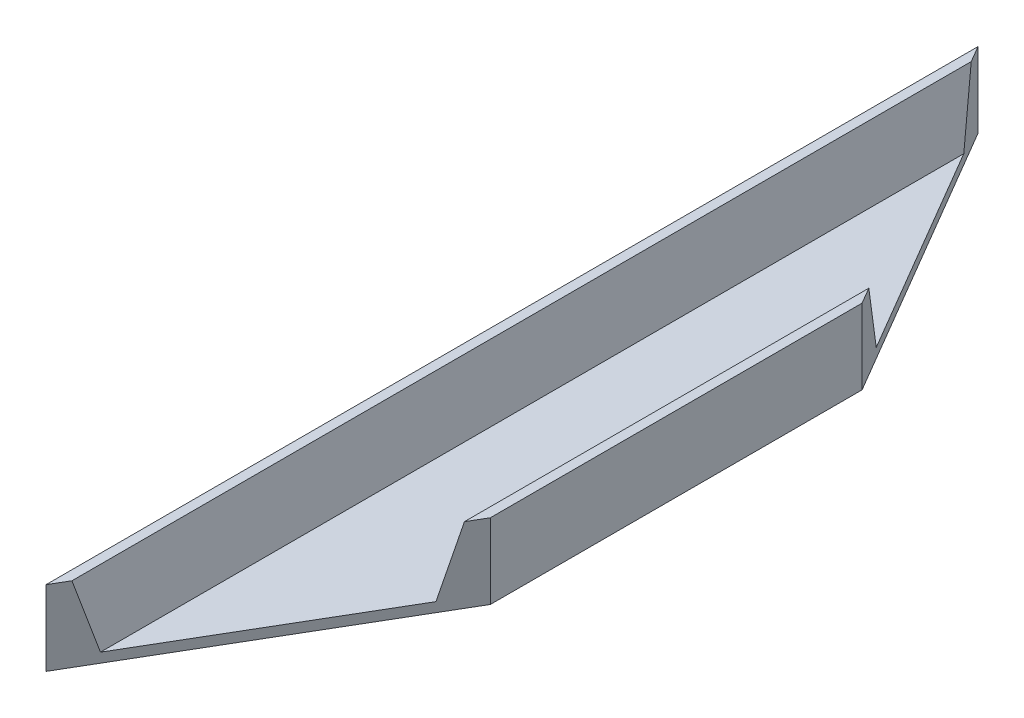
ISO-10303-21;
HEADER;
FILE_DESCRIPTION(('STEP AP214'),'2;1');
FILE_NAME('part.step','',(''),(''),'','','');
FILE_SCHEMA(('AUTOMOTIVE_DESIGN { 1 0 10303 214 1 1 1 1 }'));
ENDSEC;
DATA;
#1=APPLICATION_CONTEXT('core data for automotive mechanical design processes');
#2=APPLICATION_PROTOCOL_DEFINITION('international standard','automotive_design',2000,#1);
#3=PRODUCT_CONTEXT('',#1,'mechanical');
#4=PRODUCT('Part','Part','',(#3));
#5=PRODUCT_RELATED_PRODUCT_CATEGORY('part','',(#4));
#6=PRODUCT_DEFINITION_FORMATION('','',#4);
#7=PRODUCT_DEFINITION_CONTEXT('part definition',#1,'design');
#8=PRODUCT_DEFINITION('design','',#6,#7);
#9=PRODUCT_DEFINITION_SHAPE('','',#8);
#10=(LENGTH_UNIT() NAMED_UNIT(*) SI_UNIT(.MILLI.,.METRE.));
#11=(NAMED_UNIT(*) PLANE_ANGLE_UNIT() SI_UNIT($,.RADIAN.));
#12=(NAMED_UNIT(*) SI_UNIT($,.STERADIAN.) SOLID_ANGLE_UNIT());
#13=UNCERTAINTY_MEASURE_WITH_UNIT(LENGTH_MEASURE(1.E-05),#10,'distance_accuracy_value','');
#14=(GEOMETRIC_REPRESENTATION_CONTEXT(3) GLOBAL_UNCERTAINTY_ASSIGNED_CONTEXT((#13)) GLOBAL_UNIT_ASSIGNED_CONTEXT((#10,
#11,#12)) REPRESENTATION_CONTEXT('',''));
#15=CARTESIAN_POINT('',(0.,0.,0.));
#16=DIRECTION('',(0.,0.,1.));
#17=DIRECTION('',(1.,0.,0.));
#18=AXIS2_PLACEMENT_3D('',#15,#16,#17);
#19=CARTESIAN_POINT('',(-38.1,17.43075,432.4604));
#20=DIRECTION('',(1.,0.,0.));
#21=DIRECTION('',(0.,0.,-1.));
#22=AXIS2_PLACEMENT_3D('',#19,#20,#21);
#23=PLANE('',#22);
#24=DIRECTION('',(0.,-1.,0.));
#25=VECTOR('',#24,1.);
#26=CARTESIAN_POINT('',(-38.1,17.43075,0.));
#27=LINE('',#26,#25);
#28=CARTESIAN_POINT('',(-38.1,17.43075,0.));
#29=VERTEX_POINT('',#28);
#30=CARTESIAN_POINT('',(-38.1,-17.43075,0.));
#31=VERTEX_POINT('',#30);
#32=EDGE_CURVE('E149',#29,#31,#27,.T.);
#33=ORIENTED_EDGE('',*,*,#32,.T.);
#34=DIRECTION('',(0.,0.,-1.));
#35=VECTOR('',#34,1.);
#36=CARTESIAN_POINT('',(-38.1,-17.43075,432.4604));
#37=LINE('',#36,#35);
#38=CARTESIAN_POINT('',(-38.1,-17.43075,432.4604));
#39=VERTEX_POINT('',#38);
#40=EDGE_CURVE('E11',#39,#31,#37,.T.);
#41=ORIENTED_EDGE('',*,*,#40,.F.);
#42=DIRECTION('',(0.,-1.,0.));
#43=VECTOR('',#42,1.);
#44=CARTESIAN_POINT('',(-38.1,17.43075,432.4604));
#45=LINE('',#44,#43);
#46=CARTESIAN_POINT('',(-38.1,17.43075,432.4604));
#47=VERTEX_POINT('',#46);
#48=EDGE_CURVE('E148',#47,#39,#45,.T.);
#49=ORIENTED_EDGE('',*,*,#48,.F.);
#50=DIRECTION('',(0.,0.,-1.));
#51=VECTOR('',#50,1.);
#52=CARTESIAN_POINT('',(-38.1,17.43075,432.4604));
#53=LINE('',#52,#51);
#54=EDGE_CURVE('E144',#47,#29,#53,.T.);
#55=ORIENTED_EDGE('',*,*,#54,.T.);
#56=EDGE_LOOP('',(#33,#41,#49,#55));
#57=FACE_BOUND('',#56,.T.);
#58=ADVANCED_FACE('F41',(#57),#23,.F.);
#59=CARTESIAN_POINT('',(38.1,-17.43075,432.4604));
#60=DIRECTION('',(0.,1.,0.));
#61=DIRECTION('',(-1.,0.,0.));
#62=AXIS2_PLACEMENT_3D('',#59,#60,#61);
#63=PLANE('',#62);
#64=DIRECTION('',(0.,0.,-1.));
#65=VECTOR('',#64,1.);
#66=CARTESIAN_POINT('',(38.1,-17.43075,432.4604));
#67=LINE('',#66,#65);
#68=CARTESIAN_POINT('',(38.1,-17.43075,302.4632));
#69=VERTEX_POINT('',#68);
#70=CARTESIAN_POINT('',(38.1,-17.43075,129.9972));
#71=VERTEX_POINT('',#70);
#72=EDGE_CURVE('E50',#69,#71,#67,.T.);
#73=ORIENTED_EDGE('',*,*,#72,.F.);
#74=DIRECTION('',(-0.505693543531733,0.,0.862713185265137));
#75=VECTOR('',#74,1.);
#76=CARTESIAN_POINT('',(-38.1,-17.43075,432.4604));
#77=LINE('',#76,#75);
#78=EDGE_CURVE('E110',#69,#39,#77,.T.);
#79=ORIENTED_EDGE('',*,*,#78,.T.);
#80=ORIENTED_EDGE('',*,*,#40,.T.);
#81=DIRECTION('',(0.505693543531733,0.,0.862713185265137));
#82=VECTOR('',#81,1.);
#83=CARTESIAN_POINT('',(-38.1,-17.43075,0.));
#84=LINE('',#83,#82);
#85=EDGE_CURVE('E165',#31,#71,#84,.T.);
#86=ORIENTED_EDGE('',*,*,#85,.T.);
#87=EDGE_LOOP('',(#73,#79,#80,#86));
#88=FACE_BOUND('',#87,.T.);
#89=ADVANCED_FACE('F182',(#88),#63,.F.);
#90=CARTESIAN_POINT('',(38.1,17.43075,432.4604));
#91=DIRECTION('',(-1.,0.,0.));
#92=DIRECTION('',(0.,0.,1.));
#93=AXIS2_PLACEMENT_3D('',#90,#91,#92);
#94=PLANE('',#93);
#95=DIRECTION('',(0.,0.,-1.));
#96=VECTOR('',#95,1.);
#97=CARTESIAN_POINT('',(38.1,17.43075,432.4604));
#98=LINE('',#97,#96);
#99=CARTESIAN_POINT('',(38.1,17.43075,302.4632));
#100=VERTEX_POINT('',#99);
#101=CARTESIAN_POINT('',(38.1,17.43075,129.9972));
#102=VERTEX_POINT('',#101);
#103=EDGE_CURVE('E120',#100,#102,#98,.T.);
#104=ORIENTED_EDGE('',*,*,#103,.F.);
#105=DIRECTION('',(0.,1.,0.));
#106=VECTOR('',#105,1.);
#107=CARTESIAN_POINT('',(38.1,-17.43075,302.4632));
#108=LINE('',#107,#106);
#109=EDGE_CURVE('E104',#69,#100,#108,.T.);
#110=ORIENTED_EDGE('',*,*,#109,.F.);
#111=ORIENTED_EDGE('',*,*,#72,.T.);
#112=DIRECTION('',(0.,1.,0.));
#113=VECTOR('',#112,1.);
#114=CARTESIAN_POINT('',(38.1,-17.43075,129.9972));
#115=LINE('',#114,#113);
#116=EDGE_CURVE('E127',#71,#102,#115,.T.);
#117=ORIENTED_EDGE('',*,*,#116,.T.);
#118=EDGE_LOOP('',(#104,#110,#111,#117));
#119=FACE_BOUND('',#118,.T.);
#120=ADVANCED_FACE('F125',(#119),#94,.F.);
#121=CARTESIAN_POINT('',(33.655,17.43075,432.4604));
#122=DIRECTION('',(0.,-1.,0.));
#123=DIRECTION('',(0.,0.,-1.));
#124=AXIS2_PLACEMENT_3D('',#121,#122,#123);
#125=PLANE('',#124);
#126=DIRECTION('',(0.,0.,-1.));
#127=VECTOR('',#126,1.);
#128=CARTESIAN_POINT('',(33.655,17.43075,432.4604));
#129=LINE('',#128,#127);
#130=CARTESIAN_POINT('',(33.655,17.43075,310.04637));
#131=VERTEX_POINT('',#130);
#132=CARTESIAN_POINT('',(33.655,17.43075,122.41403));
#133=VERTEX_POINT('',#132);
#134=EDGE_CURVE('E122',#131,#133,#129,.T.);
#135=ORIENTED_EDGE('',*,*,#134,.F.);
#136=DIRECTION('',(-0.505693543531733,0.,0.862713185265137));
#137=VECTOR('',#136,1.);
#138=CARTESIAN_POINT('',(-38.1,17.43075,432.4604));
#139=LINE('',#138,#137);
#140=EDGE_CURVE('E107',#100,#131,#139,.T.);
#141=ORIENTED_EDGE('',*,*,#140,.F.);
#142=ORIENTED_EDGE('',*,*,#103,.T.);
#143=DIRECTION('',(0.505693543531733,0.,0.862713185265137));
#144=VECTOR('',#143,1.);
#145=CARTESIAN_POINT('',(-38.1,17.43075,0.));
#146=LINE('',#145,#144);
#147=EDGE_CURVE('E172',#133,#102,#146,.T.);
#148=ORIENTED_EDGE('',*,*,#147,.F.);
#149=EDGE_LOOP('',(#135,#141,#142,#148));
#150=FACE_BOUND('',#149,.T.);
#151=ADVANCED_FACE('F118',(#150),#125,.F.);
#152=CARTESIAN_POINT('',(28.7655,-12.98575,432.4604));
#153=DIRECTION('',(0.987324604076944,-0.158713976020719,0.));
#154=DIRECTION('',(0.158713976020719,0.987324604076944,0.));
#155=AXIS2_PLACEMENT_3D('',#152,#153,#154);
#156=PLANE('',#155);
#157=DIRECTION('',(0.,0.,-1.));
#158=VECTOR('',#157,1.);
#159=CARTESIAN_POINT('',(28.7655,-12.98575,432.4604));
#160=LINE('',#159,#158);
#161=CARTESIAN_POINT('',(28.7655,-12.98575,318.387857));
#162=VERTEX_POINT('',#161);
#163=CARTESIAN_POINT('',(28.7655,-12.98575,114.072543));
#164=VERTEX_POINT('',#163);
#165=EDGE_CURVE('E133',#162,#164,#160,.T.);
#166=ORIENTED_EDGE('',*,*,#165,.F.);
#167=DIRECTION('',(0.153197516089761,0.953007924766179,-0.261354962449133));
#168=VECTOR('',#167,1.);
#169=CARTESIAN_POINT('',(24.1981573144206,-41.3981804726304,326.179743621598));
#170=LINE('',#169,#168);
#171=EDGE_CURVE('E173',#162,#131,#170,.T.);
#172=ORIENTED_EDGE('',*,*,#171,.T.);
#173=ORIENTED_EDGE('',*,*,#134,.T.);
#174=DIRECTION('',(-0.153197516089761,-0.953007924766179,-0.261354962449133));
#175=VECTOR('',#174,1.);
#176=CARTESIAN_POINT('',(41.513409458337,66.3161802667977,135.820476535923));
#177=LINE('',#176,#175);
#178=EDGE_CURVE('E152',#133,#164,#177,.T.);
#179=ORIENTED_EDGE('',*,*,#178,.T.);
#180=EDGE_LOOP('',(#166,#172,#173,#179));
#181=FACE_BOUND('',#180,.T.);
#182=ADVANCED_FACE('F201',(#181),#156,.F.);
#183=CARTESIAN_POINT('',(-28.7655,-12.98575,432.4604));
#184=DIRECTION('',(0.,-1.,0.));
#185=DIRECTION('',(0.,0.,-1.));
#186=AXIS2_PLACEMENT_3D('',#183,#184,#185);
#187=PLANE('',#186);
#188=DIRECTION('',(0.,0.,-1.));
#189=VECTOR('',#188,1.);
#190=CARTESIAN_POINT('',(-28.7655,-12.98575,432.4604));
#191=LINE('',#190,#189);
#192=CARTESIAN_POINT('',(-28.7655,-12.98575,416.535743));
#193=VERTEX_POINT('',#192);
#194=CARTESIAN_POINT('',(-28.7655,-12.98575,15.924657));
#195=VERTEX_POINT('',#194);
#196=EDGE_CURVE('E138',#193,#195,#191,.T.);
#197=ORIENTED_EDGE('',*,*,#196,.F.);
#198=DIRECTION('',(0.505693543531733,0.,-0.862713185265137));
#199=VECTOR('',#198,1.);
#200=CARTESIAN_POINT('',(-35.712926026663,-12.98575,428.388051801487));
#201=LINE('',#200,#199);
#202=EDGE_CURVE('E175',#193,#162,#201,.T.);
#203=ORIENTED_EDGE('',*,*,#202,.T.);
#204=ORIENTED_EDGE('',*,*,#165,.T.);
#205=DIRECTION('',(-0.505693543531733,0.,-0.862713185265137));
#206=VECTOR('',#205,1.);
#207=CARTESIAN_POINT('',(152.955918675053,-12.98575,325.941397259641));
#208=LINE('',#207,#206);
#209=EDGE_CURVE('E157',#164,#195,#208,.T.);
#210=ORIENTED_EDGE('',*,*,#209,.T.);
#211=EDGE_LOOP('',(#197,#203,#204,#210));
#212=FACE_BOUND('',#211,.T.);
#213=ADVANCED_FACE('F198',(#212),#187,.F.);
#214=CARTESIAN_POINT('',(-33.655,17.43075,432.4604));
#215=DIRECTION('',(-0.987324604076944,-0.15871397602072,0.));
#216=DIRECTION('',(0.15871397602072,-0.987324604076944,0.));
#217=AXIS2_PLACEMENT_3D('',#214,#215,#216);
#218=PLANE('',#217);
#219=DIRECTION('',(0.,0.,-1.));
#220=VECTOR('',#219,1.);
#221=CARTESIAN_POINT('',(-33.655,17.43075,432.4604));
#222=LINE('',#221,#220);
#223=CARTESIAN_POINT('',(-33.655,17.43075,424.87723));
#224=VERTEX_POINT('',#223);
#225=CARTESIAN_POINT('',(-33.655,17.43075,7.58316999999997));
#226=VERTEX_POINT('',#225);
#227=EDGE_CURVE('E141',#224,#226,#222,.T.);
#228=ORIENTED_EDGE('',*,*,#227,.F.);
#229=DIRECTION('',(0.153197516089762,-0.953007924766179,-0.261354962449133));
#230=VECTOR('',#229,1.);
#231=CARTESIAN_POINT('',(-33.9586220208837,19.3195155584844,425.395209167628));
#232=LINE('',#231,#230);
#233=EDGE_CURVE('E114',#224,#193,#232,.T.);
#234=ORIENTED_EDGE('',*,*,#233,.T.);
#235=ORIENTED_EDGE('',*,*,#196,.T.);
#236=DIRECTION('',(-0.153197516089762,0.953007924766179,-0.261354962449133));
#237=VECTOR('',#236,1.);
#238=CARTESIAN_POINT('',(-16.6433698769673,-88.3948451809438,36.6050109898938));
#239=LINE('',#238,#237);
#240=EDGE_CURVE('E161',#195,#226,#239,.T.);
#241=ORIENTED_EDGE('',*,*,#240,.T.);
#242=EDGE_LOOP('',(#228,#234,#235,#241));
#243=FACE_BOUND('',#242,.T.);
#244=ADVANCED_FACE('F193',(#243),#218,.F.);
#245=CARTESIAN_POINT('',(-38.1,17.43075,432.4604));
#246=DIRECTION('',(0.,-1.,0.));
#247=DIRECTION('',(0.,0.,-1.));
#248=AXIS2_PLACEMENT_3D('',#245,#246,#247);
#249=PLANE('',#248);
#250=ORIENTED_EDGE('',*,*,#54,.F.);
#251=EDGE_CURVE('E56',#224,#47,#139,.T.);
#252=ORIENTED_EDGE('',*,*,#251,.F.);
#253=ORIENTED_EDGE('',*,*,#227,.T.);
#254=EDGE_CURVE('E169',#29,#226,#146,.T.);
#255=ORIENTED_EDGE('',*,*,#254,.F.);
#256=EDGE_LOOP('',(#250,#252,#253,#255));
#257=FACE_BOUND('',#256,.T.);
#258=ADVANCED_FACE('F190',(#257),#249,.F.);
#259=CARTESIAN_POINT('',(-38.1,-17.43075,0.));
#260=DIRECTION('',(-0.862713185265137,0.,0.505693543531733));
#261=DIRECTION('',(0.505693543531733,0.,0.862713185265137));
#262=AXIS2_PLACEMENT_3D('',#259,#260,#261);
#263=PLANE('',#262);
#264=ORIENTED_EDGE('',*,*,#147,.T.);
#265=ORIENTED_EDGE('',*,*,#116,.F.);
#266=ORIENTED_EDGE('',*,*,#85,.F.);
#267=ORIENTED_EDGE('',*,*,#32,.F.);
#268=ORIENTED_EDGE('',*,*,#254,.T.);
#269=ORIENTED_EDGE('',*,*,#240,.F.);
#270=ORIENTED_EDGE('',*,*,#209,.F.);
#271=ORIENTED_EDGE('',*,*,#178,.F.);
#272=EDGE_LOOP('',(#264,#265,#266,#267,#268,#269,#270,#271));
#273=FACE_BOUND('',#272,.T.);
#274=ADVANCED_FACE('F187',(#273),#263,.F.);
#275=CARTESIAN_POINT('',(-38.1,-17.43075,432.4604));
#276=DIRECTION('',(-0.862713185265137,0.,-0.505693543531733));
#277=DIRECTION('',(-0.505693543531733,0.,0.862713185265137));
#278=AXIS2_PLACEMENT_3D('',#275,#276,#277);
#279=PLANE('',#278);
#280=ORIENTED_EDGE('',*,*,#202,.F.);
#281=ORIENTED_EDGE('',*,*,#233,.F.);
#282=ORIENTED_EDGE('',*,*,#251,.T.);
#283=ORIENTED_EDGE('',*,*,#48,.T.);
#284=ORIENTED_EDGE('',*,*,#78,.F.);
#285=ORIENTED_EDGE('',*,*,#109,.T.);
#286=ORIENTED_EDGE('',*,*,#140,.T.);
#287=ORIENTED_EDGE('',*,*,#171,.F.);
#288=EDGE_LOOP('',(#280,#281,#282,#283,#284,#285,#286,#287));
#289=FACE_BOUND('',#288,.T.);
#290=ADVANCED_FACE('F106',(#289),#279,.F.);
#291=CLOSED_SHELL('',(#58,#89,#120,#151,#182,#213,#244,#258,#274,#290));
#292=MANIFOLD_SOLID_BREP('B2',#291);
#293=ADVANCED_BREP_SHAPE_REPRESENTATION('',(#18,#292),#14);
#294=SHAPE_DEFINITION_REPRESENTATION(#9,#293);
ENDSEC;
END-ISO-10303-21;
